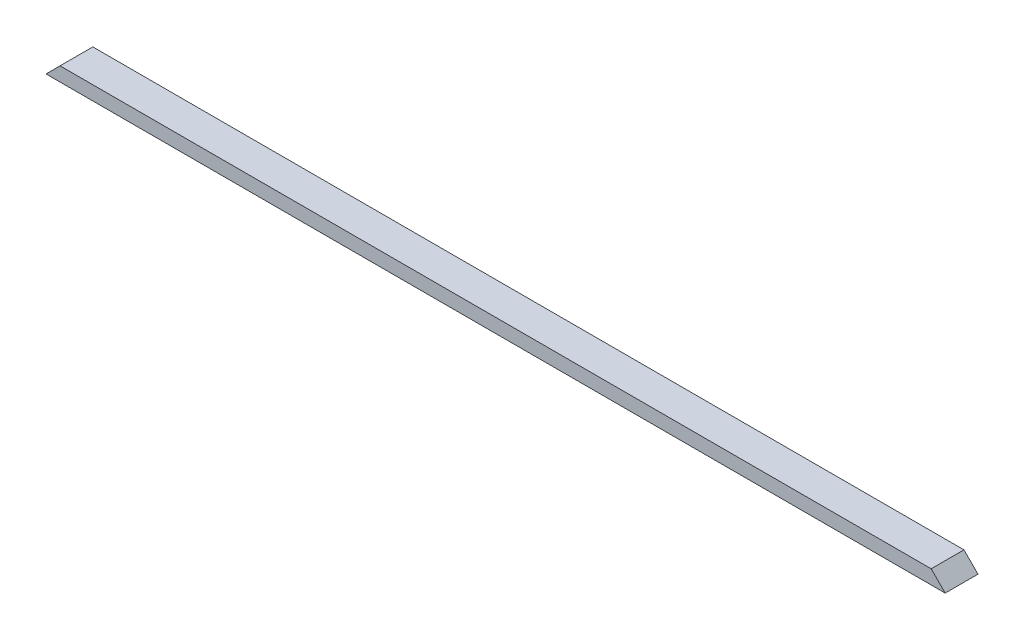
ISO-10303-21;
HEADER;
FILE_DESCRIPTION(('STEP AP214'),'2;1');
FILE_NAME('part.step','',(''),(''),'','','');
FILE_SCHEMA(('AUTOMOTIVE_DESIGN { 1 0 10303 214 1 1 1 1 }'));
ENDSEC;
DATA;
#1=APPLICATION_CONTEXT('core data for automotive mechanical design processes');
#2=APPLICATION_PROTOCOL_DEFINITION('international standard','automotive_design',2000,#1);
#3=PRODUCT_CONTEXT('',#1,'mechanical');
#4=PRODUCT('Part','Part','',(#3));
#5=PRODUCT_RELATED_PRODUCT_CATEGORY('part','',(#4));
#6=PRODUCT_DEFINITION_FORMATION('','',#4);
#7=PRODUCT_DEFINITION_CONTEXT('part definition',#1,'design');
#8=PRODUCT_DEFINITION('design','',#6,#7);
#9=PRODUCT_DEFINITION_SHAPE('','',#8);
#10=(LENGTH_UNIT() NAMED_UNIT(*) SI_UNIT(.MILLI.,.METRE.));
#11=(NAMED_UNIT(*) PLANE_ANGLE_UNIT() SI_UNIT($,.RADIAN.));
#12=(NAMED_UNIT(*) SI_UNIT($,.STERADIAN.) SOLID_ANGLE_UNIT());
#13=UNCERTAINTY_MEASURE_WITH_UNIT(LENGTH_MEASURE(1.E-05),#10,'distance_accuracy_value','');
#14=(GEOMETRIC_REPRESENTATION_CONTEXT(3) GLOBAL_UNCERTAINTY_ASSIGNED_CONTEXT((#13)) GLOBAL_UNIT_ASSIGNED_CONTEXT((#10,
#11,#12)) REPRESENTATION_CONTEXT('',''));
#15=CARTESIAN_POINT('',(0.,0.,0.));
#16=DIRECTION('',(0.,0.,1.));
#17=DIRECTION('',(1.,0.,0.));
#18=AXIS2_PLACEMENT_3D('',#15,#16,#17);
#19=CARTESIAN_POINT('',(0.,38.1,0.));
#20=DIRECTION('',(0.,0.,-1.));
#21=DIRECTION('',(-1.,0.,0.));
#22=AXIS2_PLACEMENT_3D('',#19,#20,#21);
#23=PLANE('',#22);
#24=DIRECTION('',(1.,0.,0.));
#25=VECTOR('',#24,1.);
#26=CARTESIAN_POINT('',(0.,38.1,0.));
#27=LINE('',#26,#25);
#28=CARTESIAN_POINT('',(38.1,38.1,0.));
#29=VERTEX_POINT('',#28);
#30=CARTESIAN_POINT('',(2400.3,38.1,0.));
#31=VERTEX_POINT('',#30);
#32=EDGE_CURVE('E46',#29,#31,#27,.T.);
#33=ORIENTED_EDGE('',*,*,#32,.F.);
#34=DIRECTION('',(0.707106781186547,0.707106781186547,0.));
#35=VECTOR('',#34,1.);
#36=CARTESIAN_POINT('',(0.,0.,0.));
#37=LINE('',#36,#35);
#38=CARTESIAN_POINT('',(0.,0.,0.));
#39=VERTEX_POINT('',#38);
#40=EDGE_CURVE('E81',#39,#29,#37,.T.);
#41=ORIENTED_EDGE('',*,*,#40,.F.);
#42=DIRECTION('',(1.,0.,0.));
#43=VECTOR('',#42,1.);
#44=CARTESIAN_POINT('',(0.,0.,0.));
#45=LINE('',#44,#43);
#46=CARTESIAN_POINT('',(2438.4,0.,0.));
#47=VERTEX_POINT('',#46);
#48=EDGE_CURVE('E86',#39,#47,#45,.T.);
#49=ORIENTED_EDGE('',*,*,#48,.T.);
#50=DIRECTION('',(0.707106781186548,-0.707106781186547,0.));
#51=VECTOR('',#50,1.);
#52=CARTESIAN_POINT('',(2400.3,38.1,0.));
#53=LINE('',#52,#51);
#54=EDGE_CURVE('E62',#31,#47,#53,.T.);
#55=ORIENTED_EDGE('',*,*,#54,.F.);
#56=EDGE_LOOP('',(#33,#41,#49,#55));
#57=FACE_BOUND('',#56,.T.);
#58=ADVANCED_FACE('F38',(#57),#23,.F.);
#59=CARTESIAN_POINT('',(0.,38.1,-88.9));
#60=DIRECTION('',(0.,0.,1.));
#61=DIRECTION('',(1.,0.,0.));
#62=AXIS2_PLACEMENT_3D('',#59,#60,#61);
#63=PLANE('',#62);
#64=DIRECTION('',(-1.,0.,0.));
#65=VECTOR('',#64,1.);
#66=CARTESIAN_POINT('',(0.,0.,-88.9));
#67=LINE('',#66,#65);
#68=CARTESIAN_POINT('',(2438.4,0.,-88.9));
#69=VERTEX_POINT('',#68);
#70=CARTESIAN_POINT('',(0.,0.,-88.9));
#71=VERTEX_POINT('',#70);
#72=EDGE_CURVE('E41',#69,#71,#67,.T.);
#73=ORIENTED_EDGE('',*,*,#72,.T.);
#74=DIRECTION('',(0.707106781186547,0.707106781186547,0.));
#75=VECTOR('',#74,1.);
#76=CARTESIAN_POINT('',(0.,0.,-88.9));
#77=LINE('',#76,#75);
#78=CARTESIAN_POINT('',(38.1,38.1,-88.9));
#79=VERTEX_POINT('',#78);
#80=EDGE_CURVE('E54',#71,#79,#77,.T.);
#81=ORIENTED_EDGE('',*,*,#80,.T.);
#82=DIRECTION('',(-1.,0.,0.));
#83=VECTOR('',#82,1.);
#84=CARTESIAN_POINT('',(0.,38.1,-88.9));
#85=LINE('',#84,#83);
#86=CARTESIAN_POINT('',(2400.3,38.1,-88.9));
#87=VERTEX_POINT('',#86);
#88=EDGE_CURVE('E11',#87,#79,#85,.T.);
#89=ORIENTED_EDGE('',*,*,#88,.F.);
#90=DIRECTION('',(0.707106781186548,-0.707106781186547,0.));
#91=VECTOR('',#90,1.);
#92=CARTESIAN_POINT('',(2400.3,38.1,-88.9));
#93=LINE('',#92,#91);
#94=EDGE_CURVE('E99',#87,#69,#93,.T.);
#95=ORIENTED_EDGE('',*,*,#94,.T.);
#96=EDGE_LOOP('',(#73,#81,#89,#95));
#97=FACE_BOUND('',#96,.T.);
#98=ADVANCED_FACE('F108',(#97),#63,.F.);
#99=CARTESIAN_POINT('',(0.,38.1,0.));
#100=DIRECTION('',(0.,-1.,0.));
#101=DIRECTION('',(0.,0.,-1.));
#102=AXIS2_PLACEMENT_3D('',#99,#100,#101);
#103=PLANE('',#102);
#104=ORIENTED_EDGE('',*,*,#88,.T.);
#105=DIRECTION('',(0.,0.,1.));
#106=VECTOR('',#105,1.);
#107=CARTESIAN_POINT('',(38.1,38.1,-88.9));
#108=LINE('',#107,#106);
#109=EDGE_CURVE('E87',#79,#29,#108,.T.);
#110=ORIENTED_EDGE('',*,*,#109,.T.);
#111=ORIENTED_EDGE('',*,*,#32,.T.);
#112=DIRECTION('',(0.,0.,1.));
#113=VECTOR('',#112,1.);
#114=CARTESIAN_POINT('',(2400.3,38.1,-88.9));
#115=LINE('',#114,#113);
#116=EDGE_CURVE('E102',#87,#31,#115,.T.);
#117=ORIENTED_EDGE('',*,*,#116,.F.);
#118=EDGE_LOOP('',(#104,#110,#111,#117));
#119=FACE_BOUND('',#118,.T.);
#120=ADVANCED_FACE('F111',(#119),#103,.F.);
#121=CARTESIAN_POINT('',(0.,0.,0.));
#122=DIRECTION('',(0.,-1.,0.));
#123=DIRECTION('',(0.,0.,-1.));
#124=AXIS2_PLACEMENT_3D('',#121,#122,#123);
#125=PLANE('',#124);
#126=DIRECTION('',(0.,0.,1.));
#127=VECTOR('',#126,1.);
#128=CARTESIAN_POINT('',(0.,0.,0.));
#129=LINE('',#128,#127);
#130=EDGE_CURVE('E78',#71,#39,#129,.T.);
#131=ORIENTED_EDGE('',*,*,#130,.F.);
#132=ORIENTED_EDGE('',*,*,#72,.F.);
#133=DIRECTION('',(0.,0.,-1.));
#134=VECTOR('',#133,1.);
#135=CARTESIAN_POINT('',(2438.4,0.,0.));
#136=LINE('',#135,#134);
#137=EDGE_CURVE('E95',#47,#69,#136,.T.);
#138=ORIENTED_EDGE('',*,*,#137,.F.);
#139=ORIENTED_EDGE('',*,*,#48,.F.);
#140=EDGE_LOOP('',(#131,#132,#138,#139));
#141=FACE_BOUND('',#140,.T.);
#142=ADVANCED_FACE('F94',(#141),#125,.T.);
#143=CARTESIAN_POINT('',(2400.3,38.1,-88.9));
#144=DIRECTION('',(-0.707106781186547,-0.707106781186548,0.));
#145=DIRECTION('',(0.707106781186548,-0.707106781186547,0.));
#146=AXIS2_PLACEMENT_3D('',#143,#144,#145);
#147=PLANE('',#146);
#148=ORIENTED_EDGE('',*,*,#54,.T.);
#149=ORIENTED_EDGE('',*,*,#137,.T.);
#150=ORIENTED_EDGE('',*,*,#94,.F.);
#151=ORIENTED_EDGE('',*,*,#116,.T.);
#152=EDGE_LOOP('',(#148,#149,#150,#151));
#153=FACE_BOUND('',#152,.T.);
#154=ADVANCED_FACE('F112',(#153),#147,.F.);
#155=CARTESIAN_POINT('',(0.,0.,-88.9));
#156=DIRECTION('',(0.707106781186547,-0.707106781186547,0.));
#157=DIRECTION('',(0.707106781186548,0.707106781186548,0.));
#158=AXIS2_PLACEMENT_3D('',#155,#156,#157);
#159=PLANE('',#158);
#160=ORIENTED_EDGE('',*,*,#40,.T.);
#161=ORIENTED_EDGE('',*,*,#109,.F.);
#162=ORIENTED_EDGE('',*,*,#80,.F.);
#163=ORIENTED_EDGE('',*,*,#130,.T.);
#164=EDGE_LOOP('',(#160,#161,#162,#163));
#165=FACE_BOUND('',#164,.T.);
#166=ADVANCED_FACE('F80',(#165),#159,.F.);
#167=CLOSED_SHELL('',(#58,#98,#120,#142,#154,#166));
#168=MANIFOLD_SOLID_BREP('B2',#167);
#169=ADVANCED_BREP_SHAPE_REPRESENTATION('',(#18,#168),#14);
#170=SHAPE_DEFINITION_REPRESENTATION(#9,#169);
ENDSEC;
END-ISO-10303-21;
